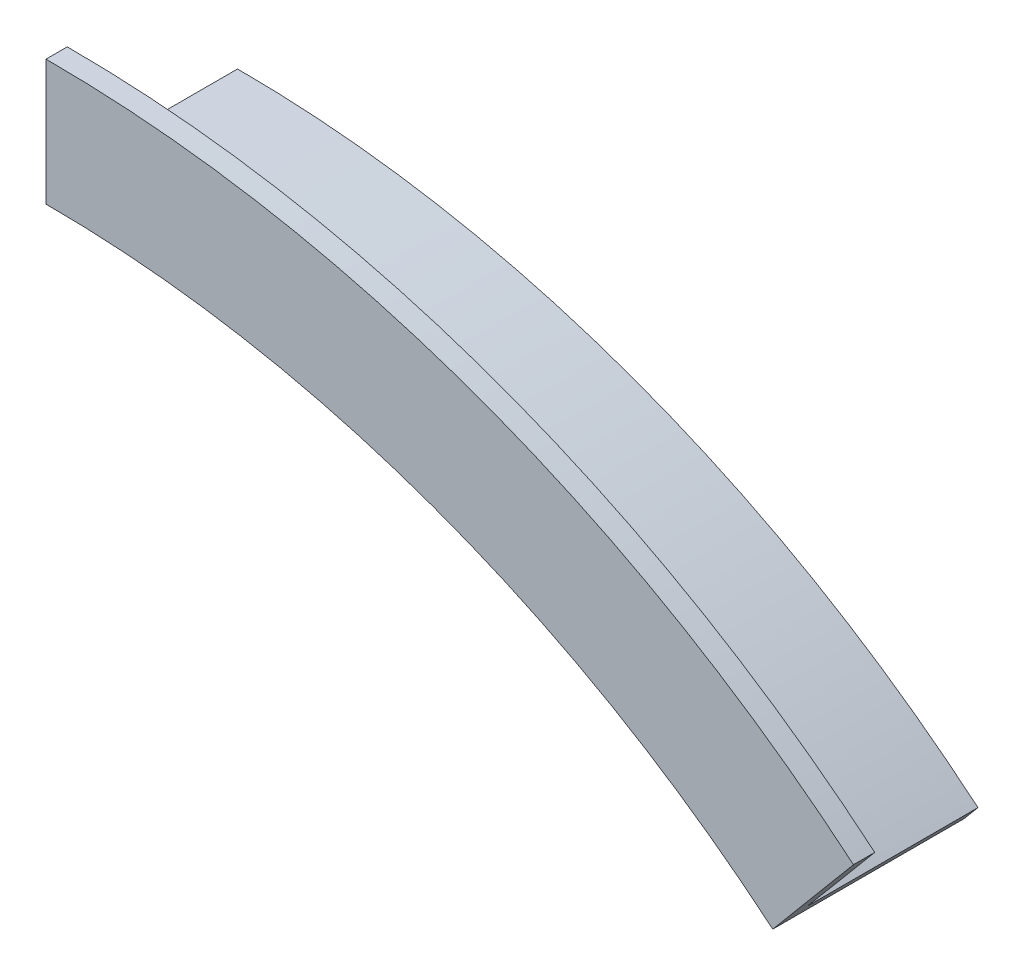
ISO-10303-21;
HEADER;
FILE_DESCRIPTION(('STEP AP214'),'2;1');
FILE_NAME('part.step','',(''),(''),'','','');
FILE_SCHEMA(('AUTOMOTIVE_DESIGN { 1 0 10303 214 1 1 1 1 }'));
ENDSEC;
DATA;
#1=APPLICATION_CONTEXT('core data for automotive mechanical design processes');
#2=APPLICATION_PROTOCOL_DEFINITION('international standard','automotive_design',2000,#1);
#3=PRODUCT_CONTEXT('',#1,'mechanical');
#4=PRODUCT('Part','Part','',(#3));
#5=PRODUCT_RELATED_PRODUCT_CATEGORY('part','',(#4));
#6=PRODUCT_DEFINITION_FORMATION('','',#4);
#7=PRODUCT_DEFINITION_CONTEXT('part definition',#1,'design');
#8=PRODUCT_DEFINITION('design','',#6,#7);
#9=PRODUCT_DEFINITION_SHAPE('','',#8);
#10=(LENGTH_UNIT() NAMED_UNIT(*) SI_UNIT(.MILLI.,.METRE.));
#11=(NAMED_UNIT(*) PLANE_ANGLE_UNIT() SI_UNIT($,.RADIAN.));
#12=(NAMED_UNIT(*) SI_UNIT($,.STERADIAN.) SOLID_ANGLE_UNIT());
#13=UNCERTAINTY_MEASURE_WITH_UNIT(LENGTH_MEASURE(1.E-05),#10,'distance_accuracy_value','');
#14=(GEOMETRIC_REPRESENTATION_CONTEXT(3) GLOBAL_UNCERTAINTY_ASSIGNED_CONTEXT((#13)) GLOBAL_UNIT_ASSIGNED_CONTEXT((#10,
#11,#12)) REPRESENTATION_CONTEXT('',''));
#15=CARTESIAN_POINT('',(0.,0.,0.));
#16=DIRECTION('',(0.,0.,1.));
#17=DIRECTION('',(1.,0.,0.));
#18=AXIS2_PLACEMENT_3D('',#15,#16,#17);
#19=CARTESIAN_POINT('',(0.,0.,3.175));
#20=DIRECTION('',(0.,0.,1.));
#21=DIRECTION('',(1.,0.,0.));
#22=AXIS2_PLACEMENT_3D('',#19,#20,#21);
#23=PLANE('',#22);
#24=CARTESIAN_POINT('',(0.,0.,3.175));
#25=DIRECTION('',(0.,0.,1.));
#26=DIRECTION('',(1.,0.,0.));
#27=AXIS2_PLACEMENT_3D('',#24,#25,#26);
#28=CIRCLE('',#27,171.831);
#29=CARTESIAN_POINT('',(110.45083776005,131.630182705575,3.175));
#30=VERTEX_POINT('',#29);
#31=CARTESIAN_POINT('',(0.,171.831,3.175));
#32=VERTEX_POINT('',#31);
#33=EDGE_CURVE('E94',#30,#32,#28,.T.);
#34=ORIENTED_EDGE('',*,*,#33,.F.);
#35=DIRECTION('',(-0.642787609686557,-0.766044443118963,0.));
#36=VECTOR('',#35,1.);
#37=CARTESIAN_POINT('',(31.933335807858,38.056667672532,3.175));
#38=LINE('',#37,#36);
#39=CARTESIAN_POINT('',(108.409987099295,129.197991598673,3.175));
#40=VERTEX_POINT('',#39);
#41=EDGE_CURVE('E40',#30,#40,#38,.T.);
#42=ORIENTED_EDGE('',*,*,#41,.T.);
#43=CARTESIAN_POINT('',(0.,0.,3.175));
#44=DIRECTION('',(0.,0.,1.));
#45=DIRECTION('',(1.,0.,0.));
#46=AXIS2_PLACEMENT_3D('',#43,#44,#45);
#47=CIRCLE('',#46,168.656);
#48=CARTESIAN_POINT('',(0.,168.656,3.175));
#49=VERTEX_POINT('',#48);
#50=EDGE_CURVE('E11',#40,#49,#47,.T.);
#51=ORIENTED_EDGE('',*,*,#50,.T.);
#52=DIRECTION('',(0.,-1.,0.));
#53=VECTOR('',#52,1.);
#54=CARTESIAN_POINT('',(0.,49.6794513874194,3.175));
#55=LINE('',#54,#53);
#56=EDGE_CURVE('E35',#32,#49,#55,.T.);
#57=ORIENTED_EDGE('',*,*,#56,.F.);
#58=EDGE_LOOP('',(#34,#42,#51,#57));
#59=FACE_BOUND('',#58,.T.);
#60=ADVANCED_FACE('F32',(#59),#23,.F.);
#61=CARTESIAN_POINT('',(0.,49.6794513874194,-0.01));
#62=DIRECTION('',(1.,0.,0.));
#63=DIRECTION('',(0.,1.,0.));
#64=AXIS2_PLACEMENT_3D('',#61,#62,#63);
#65=PLANE('',#64);
#66=DIRECTION('',(0.,0.,-1.));
#67=VECTOR('',#66,1.);
#68=CARTESIAN_POINT('',(0.,171.831,28.575));
#69=LINE('',#68,#67);
#70=CARTESIAN_POINT('',(0.,171.831,28.575));
#71=VERTEX_POINT('',#70);
#72=EDGE_CURVE('E105',#32,#71,#69,.F.);
#73=ORIENTED_EDGE('',*,*,#72,.F.);
#74=ORIENTED_EDGE('',*,*,#56,.T.);
#75=DIRECTION('',(0.,0.,-1.));
#76=VECTOR('',#75,1.);
#77=CARTESIAN_POINT('',(0.,168.656,3.175));
#78=LINE('',#77,#76);
#79=CARTESIAN_POINT('',(0.,168.656,31.75));
#80=VERTEX_POINT('',#79);
#81=EDGE_CURVE('E128',#49,#80,#78,.F.);
#82=ORIENTED_EDGE('',*,*,#81,.T.);
#83=DIRECTION('',(0.,1.,0.));
#84=VECTOR('',#83,1.);
#85=CARTESIAN_POINT('',(0.,0.,31.75));
#86=LINE('',#85,#84);
#87=CARTESIAN_POINT('',(0.,187.3885,31.75));
#88=VERTEX_POINT('',#87);
#89=EDGE_CURVE('E113',#80,#88,#86,.T.);
#90=ORIENTED_EDGE('',*,*,#89,.T.);
#91=DIRECTION('',(0.,0.,-1.));
#92=VECTOR('',#91,1.);
#93=CARTESIAN_POINT('',(0.,187.3885,31.75));
#94=LINE('',#93,#92);
#95=CARTESIAN_POINT('',(0.,187.3885,28.575));
#96=VERTEX_POINT('',#95);
#97=EDGE_CURVE('E89',#96,#88,#94,.F.);
#98=ORIENTED_EDGE('',*,*,#97,.F.);
#99=DIRECTION('',(0.,1.,0.));
#100=VECTOR('',#99,1.);
#101=CARTESIAN_POINT('',(0.,0.,28.575));
#102=LINE('',#101,#100);
#103=EDGE_CURVE('E104',#71,#96,#102,.T.);
#104=ORIENTED_EDGE('',*,*,#103,.F.);
#105=EDGE_LOOP('',(#73,#74,#82,#90,#98,#104));
#106=FACE_BOUND('',#105,.T.);
#107=ADVANCED_FACE('F134',(#106),#65,.F.);
#108=CARTESIAN_POINT('',(31.933335807858,38.056667672532,-0.01));
#109=DIRECTION('',(0.766044443118963,-0.642787609686557,0.));
#110=DIRECTION('',(0.642787609686557,0.766044443118963,0.));
#111=AXIS2_PLACEMENT_3D('',#108,#109,#110);
#112=PLANE('',#111);
#113=ORIENTED_EDGE('',*,*,#41,.F.);
#114=DIRECTION('',(0.,0.,-1.));
#115=VECTOR('',#114,1.);
#116=CARTESIAN_POINT('',(110.45083776005,131.630182705575,28.575));
#117=LINE('',#116,#115);
#118=CARTESIAN_POINT('',(110.45083776005,131.630182705575,28.575));
#119=VERTEX_POINT('',#118);
#120=EDGE_CURVE('E131',#30,#119,#117,.F.);
#121=ORIENTED_EDGE('',*,*,#120,.T.);
#122=DIRECTION('',(0.642787609686557,0.766044443118963,0.));
#123=VECTOR('',#122,1.);
#124=CARTESIAN_POINT('',(-8.39849176403869E-13,7.04717134165062E-13,28.575));
#125=LINE('',#124,#123);
#126=CARTESIAN_POINT('',(120.451005997749,143.547919129398,28.575));
#127=VERTEX_POINT('',#126);
#128=EDGE_CURVE('E111',#119,#127,#125,.T.);
#129=ORIENTED_EDGE('',*,*,#128,.T.);
#130=DIRECTION('',(0.,0.,-1.));
#131=VECTOR('',#130,1.);
#132=CARTESIAN_POINT('',(120.451005997749,143.547919129398,31.75));
#133=LINE('',#132,#131);
#134=CARTESIAN_POINT('',(120.451005997749,143.547919129398,31.75));
#135=VERTEX_POINT('',#134);
#136=EDGE_CURVE('E87',#127,#135,#133,.F.);
#137=ORIENTED_EDGE('',*,*,#136,.T.);
#138=DIRECTION('',(0.642787609686557,0.766044443118963,0.));
#139=VECTOR('',#138,1.);
#140=CARTESIAN_POINT('',(-8.39849176403869E-13,7.04717134165062E-13,31.75));
#141=LINE('',#140,#139);
#142=CARTESIAN_POINT('',(108.409987099295,129.197991598673,31.75));
#143=VERTEX_POINT('',#142);
#144=EDGE_CURVE('E98',#143,#135,#141,.T.);
#145=ORIENTED_EDGE('',*,*,#144,.F.);
#146=DIRECTION('',(0.,0.,-1.));
#147=VECTOR('',#146,1.);
#148=CARTESIAN_POINT('',(108.409987099295,129.197991598673,3.175));
#149=LINE('',#148,#147);
#150=EDGE_CURVE('E127',#40,#143,#149,.F.);
#151=ORIENTED_EDGE('',*,*,#150,.F.);
#152=EDGE_LOOP('',(#113,#121,#129,#137,#145,#151));
#153=FACE_BOUND('',#152,.T.);
#154=ADVANCED_FACE('F108',(#153),#112,.T.);
#155=CARTESIAN_POINT('',(0.,0.,3.175));
#156=DIRECTION('',(0.,0.,-1.));
#157=DIRECTION('',(-1.,0.,0.));
#158=AXIS2_PLACEMENT_3D('',#155,#156,#157);
#159=CYLINDRICAL_SURFACE('',#158,168.656);
#160=ORIENTED_EDGE('',*,*,#50,.F.);
#161=ORIENTED_EDGE('',*,*,#150,.T.);
#162=CARTESIAN_POINT('',(0.,0.,31.75));
#163=DIRECTION('',(0.,0.,1.));
#164=DIRECTION('',(1.,0.,0.));
#165=AXIS2_PLACEMENT_3D('',#162,#163,#164);
#166=CIRCLE('',#165,168.656);
#167=EDGE_CURVE('E101',#143,#80,#166,.T.);
#168=ORIENTED_EDGE('',*,*,#167,.T.);
#169=ORIENTED_EDGE('',*,*,#81,.F.);
#170=EDGE_LOOP('',(#160,#161,#168,#169));
#171=FACE_BOUND('',#170,.T.);
#172=ADVANCED_FACE('F136',(#171),#159,.F.);
#173=CARTESIAN_POINT('',(0.,0.,28.575));
#174=DIRECTION('',(0.,0.,-1.));
#175=DIRECTION('',(-1.,0.,0.));
#176=AXIS2_PLACEMENT_3D('',#173,#174,#175);
#177=CYLINDRICAL_SURFACE('',#176,171.831);
#178=ORIENTED_EDGE('',*,*,#120,.F.);
#179=ORIENTED_EDGE('',*,*,#33,.T.);
#180=ORIENTED_EDGE('',*,*,#72,.T.);
#181=CARTESIAN_POINT('',(0.,0.,28.575));
#182=DIRECTION('',(0.,0.,1.));
#183=DIRECTION('',(1.,0.,0.));
#184=AXIS2_PLACEMENT_3D('',#181,#182,#183);
#185=CIRCLE('',#184,171.831);
#186=EDGE_CURVE('E117',#119,#71,#185,.T.);
#187=ORIENTED_EDGE('',*,*,#186,.F.);
#188=EDGE_LOOP('',(#178,#179,#180,#187));
#189=FACE_BOUND('',#188,.T.);
#190=ADVANCED_FACE('F138',(#189),#177,.T.);
#191=CARTESIAN_POINT('',(0.,0.,31.75));
#192=DIRECTION('',(0.,0.,1.));
#193=DIRECTION('',(1.,0.,0.));
#194=AXIS2_PLACEMENT_3D('',#191,#192,#193);
#195=PLANE('',#194);
#196=ORIENTED_EDGE('',*,*,#167,.F.);
#197=ORIENTED_EDGE('',*,*,#144,.T.);
#198=CARTESIAN_POINT('',(0.,0.,31.75));
#199=DIRECTION('',(0.,0.,1.));
#200=DIRECTION('',(1.,0.,0.));
#201=AXIS2_PLACEMENT_3D('',#198,#199,#200);
#202=CIRCLE('',#201,187.3885);
#203=EDGE_CURVE('E82',#135,#88,#202,.T.);
#204=ORIENTED_EDGE('',*,*,#203,.T.);
#205=ORIENTED_EDGE('',*,*,#89,.F.);
#206=EDGE_LOOP('',(#196,#197,#204,#205));
#207=FACE_BOUND('',#206,.T.);
#208=ADVANCED_FACE('F99',(#207),#195,.T.);
#209=CARTESIAN_POINT('',(0.,0.,28.575));
#210=DIRECTION('',(0.,0.,1.));
#211=DIRECTION('',(1.,0.,0.));
#212=AXIS2_PLACEMENT_3D('',#209,#210,#211);
#213=PLANE('',#212);
#214=ORIENTED_EDGE('',*,*,#128,.F.);
#215=ORIENTED_EDGE('',*,*,#186,.T.);
#216=ORIENTED_EDGE('',*,*,#103,.T.);
#217=CARTESIAN_POINT('',(0.,0.,28.575));
#218=DIRECTION('',(0.,0.,1.));
#219=DIRECTION('',(1.,0.,0.));
#220=AXIS2_PLACEMENT_3D('',#217,#218,#219);
#221=CIRCLE('',#220,187.3885);
#222=EDGE_CURVE('E93',#127,#96,#221,.T.);
#223=ORIENTED_EDGE('',*,*,#222,.F.);
#224=EDGE_LOOP('',(#214,#215,#216,#223));
#225=FACE_BOUND('',#224,.T.);
#226=ADVANCED_FACE('F188',(#225),#213,.F.);
#227=CARTESIAN_POINT('',(0.,0.,31.75));
#228=DIRECTION('',(0.,0.,-1.));
#229=DIRECTION('',(-1.,0.,0.));
#230=AXIS2_PLACEMENT_3D('',#227,#228,#229);
#231=CYLINDRICAL_SURFACE('',#230,187.3885);
#232=ORIENTED_EDGE('',*,*,#136,.F.);
#233=ORIENTED_EDGE('',*,*,#222,.T.);
#234=ORIENTED_EDGE('',*,*,#97,.T.);
#235=ORIENTED_EDGE('',*,*,#203,.F.);
#236=EDGE_LOOP('',(#232,#233,#234,#235));
#237=FACE_BOUND('',#236,.T.);
#238=ADVANCED_FACE('F84',(#237),#231,.T.);
#239=CLOSED_SHELL('',(#60,#107,#154,#172,#190,#208,#226,#238));
#240=MANIFOLD_SOLID_BREP('B2',#239);
#241=ADVANCED_BREP_SHAPE_REPRESENTATION('',(#18,#240),#14);
#242=SHAPE_DEFINITION_REPRESENTATION(#9,#241);
ENDSEC;
END-ISO-10303-21;
